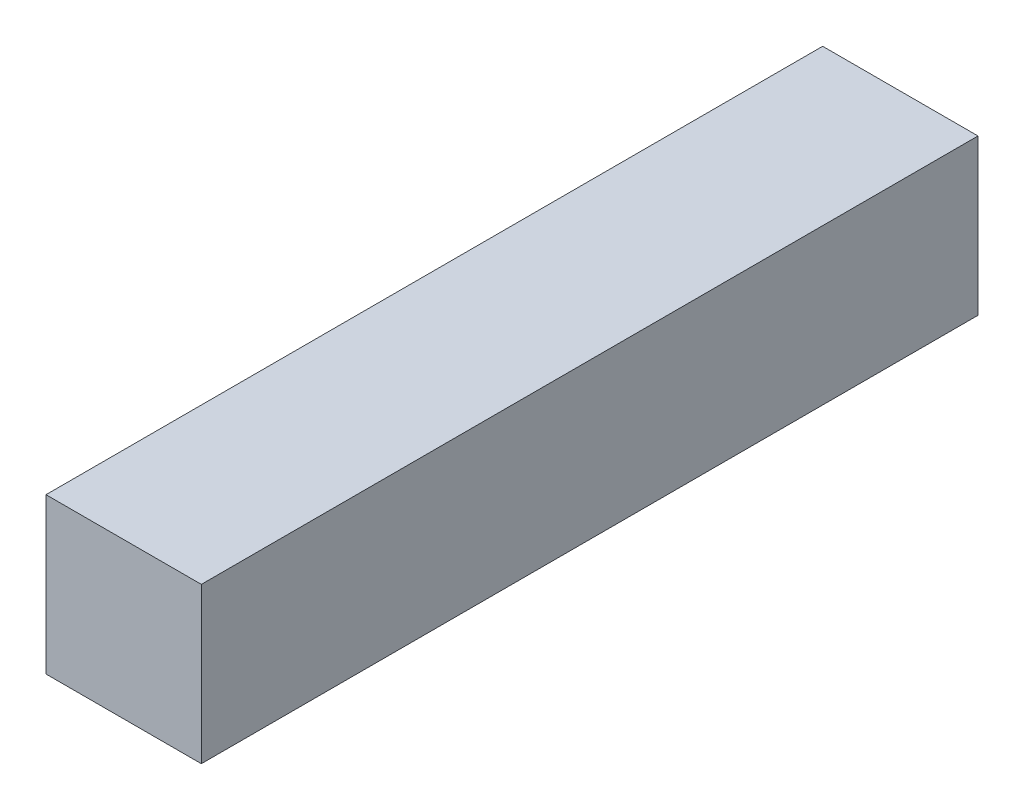
ISO-10303-21;
HEADER;
FILE_DESCRIPTION(('STEP AP214'),'2;1');
FILE_NAME('part.step','',(''),(''),'','','');
FILE_SCHEMA(('AUTOMOTIVE_DESIGN { 1 0 10303 214 1 1 1 1 }'));
ENDSEC;
DATA;
#1=APPLICATION_CONTEXT('core data for automotive mechanical design processes');
#2=APPLICATION_PROTOCOL_DEFINITION('international standard','automotive_design',2000,#1);
#3=PRODUCT_CONTEXT('',#1,'mechanical');
#4=PRODUCT('Part','Part','',(#3));
#5=PRODUCT_RELATED_PRODUCT_CATEGORY('part','',(#4));
#6=PRODUCT_DEFINITION_FORMATION('','',#4);
#7=PRODUCT_DEFINITION_CONTEXT('part definition',#1,'design');
#8=PRODUCT_DEFINITION('design','',#6,#7);
#9=PRODUCT_DEFINITION_SHAPE('','',#8);
#10=(LENGTH_UNIT() NAMED_UNIT(*) SI_UNIT(.MILLI.,.METRE.));
#11=(NAMED_UNIT(*) PLANE_ANGLE_UNIT() SI_UNIT($,.RADIAN.));
#12=(NAMED_UNIT(*) SI_UNIT($,.STERADIAN.) SOLID_ANGLE_UNIT());
#13=UNCERTAINTY_MEASURE_WITH_UNIT(LENGTH_MEASURE(1.E-05),#10,'distance_accuracy_value','');
#14=(GEOMETRIC_REPRESENTATION_CONTEXT(3) GLOBAL_UNCERTAINTY_ASSIGNED_CONTEXT((#13)) GLOBAL_UNIT_ASSIGNED_CONTEXT((#10,
#11,#12)) REPRESENTATION_CONTEXT('',''));
#15=CARTESIAN_POINT('',(0.,0.,0.));
#16=DIRECTION('',(0.,0.,1.));
#17=DIRECTION('',(1.,0.,0.));
#18=AXIS2_PLACEMENT_3D('',#15,#16,#17);
#19=CARTESIAN_POINT('',(-3.175,3.175,31.75));
#20=DIRECTION('',(1.,0.,0.));
#21=DIRECTION('',(0.,1.,0.));
#22=AXIS2_PLACEMENT_3D('',#19,#20,#21);
#23=PLANE('',#22);
#24=DIRECTION('',(0.,-1.,0.));
#25=VECTOR('',#24,1.);
#26=CARTESIAN_POINT('',(-3.175,3.175,0.));
#27=LINE('',#26,#25);
#28=CARTESIAN_POINT('',(-3.175,3.175,0.));
#29=VERTEX_POINT('',#28);
#30=CARTESIAN_POINT('',(-3.175,-3.175,0.));
#31=VERTEX_POINT('',#30);
#32=EDGE_CURVE('E100',#29,#31,#27,.T.);
#33=ORIENTED_EDGE('',*,*,#32,.T.);
#34=DIRECTION('',(0.,0.,-1.));
#35=VECTOR('',#34,1.);
#36=CARTESIAN_POINT('',(-3.175,-3.175,31.75));
#37=LINE('',#36,#35);
#38=CARTESIAN_POINT('',(-3.175,-3.175,31.75));
#39=VERTEX_POINT('',#38);
#40=EDGE_CURVE('E11',#39,#31,#37,.T.);
#41=ORIENTED_EDGE('',*,*,#40,.F.);
#42=DIRECTION('',(0.,-1.,0.));
#43=VECTOR('',#42,1.);
#44=CARTESIAN_POINT('',(-3.175,3.175,31.75));
#45=LINE('',#44,#43);
#46=CARTESIAN_POINT('',(-3.175,3.175,31.75));
#47=VERTEX_POINT('',#46);
#48=EDGE_CURVE('E88',#47,#39,#45,.T.);
#49=ORIENTED_EDGE('',*,*,#48,.F.);
#50=DIRECTION('',(0.,0.,-1.));
#51=VECTOR('',#50,1.);
#52=CARTESIAN_POINT('',(-3.175,3.175,31.75));
#53=LINE('',#52,#51);
#54=EDGE_CURVE('E96',#47,#29,#53,.T.);
#55=ORIENTED_EDGE('',*,*,#54,.T.);
#56=EDGE_LOOP('',(#33,#41,#49,#55));
#57=FACE_BOUND('',#56,.T.);
#58=ADVANCED_FACE('F37',(#57),#23,.F.);
#59=CARTESIAN_POINT('',(3.175,-3.175,31.75));
#60=DIRECTION('',(0.,1.,0.));
#61=DIRECTION('',(-1.,0.,0.));
#62=AXIS2_PLACEMENT_3D('',#59,#60,#61);
#63=PLANE('',#62);
#64=DIRECTION('',(1.,0.,0.));
#65=VECTOR('',#64,1.);
#66=CARTESIAN_POINT('',(3.175,-3.175,0.));
#67=LINE('',#66,#65);
#68=CARTESIAN_POINT('',(3.175,-3.175,0.));
#69=VERTEX_POINT('',#68);
#70=EDGE_CURVE('E92',#31,#69,#67,.T.);
#71=ORIENTED_EDGE('',*,*,#70,.T.);
#72=DIRECTION('',(0.,0.,-1.));
#73=VECTOR('',#72,1.);
#74=CARTESIAN_POINT('',(3.175,-3.175,31.75));
#75=LINE('',#74,#73);
#76=CARTESIAN_POINT('',(3.175,-3.175,31.75));
#77=VERTEX_POINT('',#76);
#78=EDGE_CURVE('E45',#77,#69,#75,.T.);
#79=ORIENTED_EDGE('',*,*,#78,.F.);
#80=DIRECTION('',(1.,0.,0.));
#81=VECTOR('',#80,1.);
#82=CARTESIAN_POINT('',(3.175,-3.175,31.75));
#83=LINE('',#82,#81);
#84=EDGE_CURVE('E83',#39,#77,#83,.T.);
#85=ORIENTED_EDGE('',*,*,#84,.F.);
#86=ORIENTED_EDGE('',*,*,#40,.T.);
#87=EDGE_LOOP('',(#71,#79,#85,#86));
#88=FACE_BOUND('',#87,.T.);
#89=ADVANCED_FACE('F91',(#88),#63,.F.);
#90=CARTESIAN_POINT('',(3.175,3.175,31.75));
#91=DIRECTION('',(-1.,0.,0.));
#92=DIRECTION('',(0.,-1.,0.));
#93=AXIS2_PLACEMENT_3D('',#90,#91,#92);
#94=PLANE('',#93);
#95=DIRECTION('',(0.,1.,0.));
#96=VECTOR('',#95,1.);
#97=CARTESIAN_POINT('',(3.175,3.175,0.));
#98=LINE('',#97,#96);
#99=CARTESIAN_POINT('',(3.175,3.175,0.));
#100=VERTEX_POINT('',#99);
#101=EDGE_CURVE('E70',#69,#100,#98,.T.);
#102=ORIENTED_EDGE('',*,*,#101,.T.);
#103=DIRECTION('',(0.,0.,-1.));
#104=VECTOR('',#103,1.);
#105=CARTESIAN_POINT('',(3.175,3.175,31.75));
#106=LINE('',#105,#104);
#107=CARTESIAN_POINT('',(3.175,3.175,31.75));
#108=VERTEX_POINT('',#107);
#109=EDGE_CURVE('E93',#108,#100,#106,.T.);
#110=ORIENTED_EDGE('',*,*,#109,.F.);
#111=DIRECTION('',(0.,1.,0.));
#112=VECTOR('',#111,1.);
#113=CARTESIAN_POINT('',(3.175,3.175,31.75));
#114=LINE('',#113,#112);
#115=EDGE_CURVE('E86',#77,#108,#114,.T.);
#116=ORIENTED_EDGE('',*,*,#115,.F.);
#117=ORIENTED_EDGE('',*,*,#78,.T.);
#118=EDGE_LOOP('',(#102,#110,#116,#117));
#119=FACE_BOUND('',#118,.T.);
#120=ADVANCED_FACE('F94',(#119),#94,.F.);
#121=CARTESIAN_POINT('',(3.175,3.175,31.75));
#122=DIRECTION('',(0.,-1.,0.));
#123=DIRECTION('',(1.,0.,0.));
#124=AXIS2_PLACEMENT_3D('',#121,#122,#123);
#125=PLANE('',#124);
#126=DIRECTION('',(-1.,0.,0.));
#127=VECTOR('',#126,1.);
#128=CARTESIAN_POINT('',(3.175,3.175,0.));
#129=LINE('',#128,#127);
#130=EDGE_CURVE('E76',#100,#29,#129,.T.);
#131=ORIENTED_EDGE('',*,*,#130,.T.);
#132=ORIENTED_EDGE('',*,*,#54,.F.);
#133=DIRECTION('',(-1.,0.,0.));
#134=VECTOR('',#133,1.);
#135=CARTESIAN_POINT('',(3.175,3.175,31.75));
#136=LINE('',#135,#134);
#137=EDGE_CURVE('E53',#108,#47,#136,.T.);
#138=ORIENTED_EDGE('',*,*,#137,.F.);
#139=ORIENTED_EDGE('',*,*,#109,.T.);
#140=EDGE_LOOP('',(#131,#132,#138,#139));
#141=FACE_BOUND('',#140,.T.);
#142=ADVANCED_FACE('F107',(#141),#125,.F.);
#143=CARTESIAN_POINT('',(0.,0.,31.75));
#144=DIRECTION('',(0.,0.,-1.));
#145=DIRECTION('',(-1.,0.,0.));
#146=AXIS2_PLACEMENT_3D('',#143,#144,#145);
#147=PLANE('',#146);
#148=ORIENTED_EDGE('',*,*,#48,.T.);
#149=ORIENTED_EDGE('',*,*,#84,.T.);
#150=ORIENTED_EDGE('',*,*,#115,.T.);
#151=ORIENTED_EDGE('',*,*,#137,.T.);
#152=EDGE_LOOP('',(#148,#149,#150,#151));
#153=FACE_BOUND('',#152,.T.);
#154=ADVANCED_FACE('F84',(#153),#147,.F.);
#155=CARTESIAN_POINT('',(0.,0.,0.));
#156=DIRECTION('',(0.,0.,-1.));
#157=DIRECTION('',(-1.,0.,0.));
#158=AXIS2_PLACEMENT_3D('',#155,#156,#157);
#159=PLANE('',#158);
#160=ORIENTED_EDGE('',*,*,#32,.F.);
#161=ORIENTED_EDGE('',*,*,#130,.F.);
#162=ORIENTED_EDGE('',*,*,#101,.F.);
#163=ORIENTED_EDGE('',*,*,#70,.F.);
#164=EDGE_LOOP('',(#160,#161,#162,#163));
#165=FACE_BOUND('',#164,.T.);
#166=ADVANCED_FACE('F110',(#165),#159,.T.);
#167=CLOSED_SHELL('',(#58,#89,#120,#142,#154,#166));
#168=MANIFOLD_SOLID_BREP('B2',#167);
#169=ADVANCED_BREP_SHAPE_REPRESENTATION('',(#18,#168),#14);
#170=SHAPE_DEFINITION_REPRESENTATION(#9,#169);
ENDSEC;
END-ISO-10303-21;
